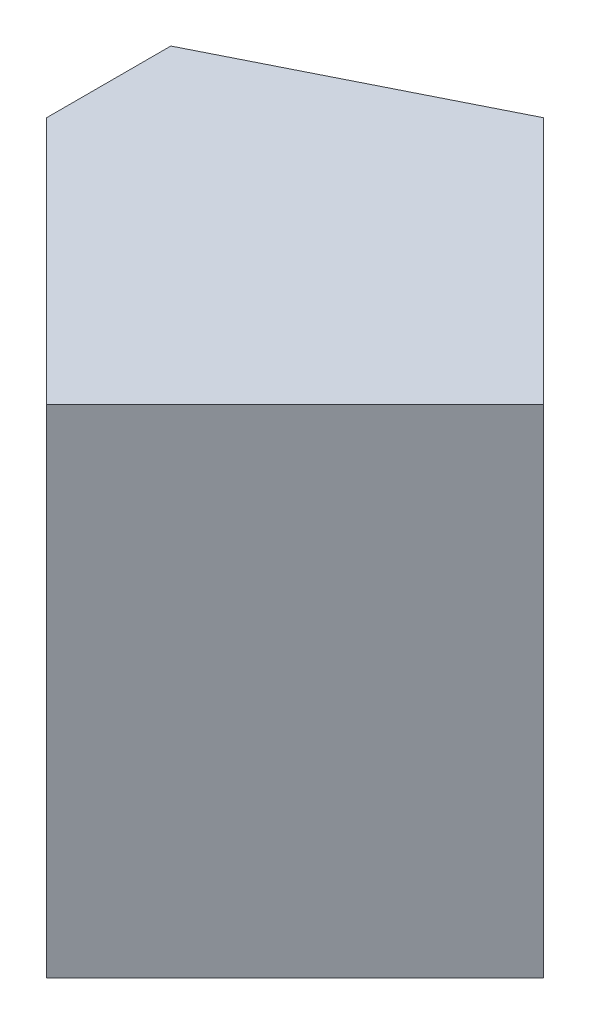
ISO-10303-21;
HEADER;
FILE_DESCRIPTION(('STEP AP214'),'2;1');
FILE_NAME('part.step','',(''),(''),'','','');
FILE_SCHEMA(('AUTOMOTIVE_DESIGN { 1 0 10303 214 1 1 1 1 }'));
ENDSEC;
DATA;
#1=APPLICATION_CONTEXT('core data for automotive mechanical design processes');
#2=APPLICATION_PROTOCOL_DEFINITION('international standard','automotive_design',2000,#1);
#3=PRODUCT_CONTEXT('',#1,'mechanical');
#4=PRODUCT('Part','Part','',(#3));
#5=PRODUCT_RELATED_PRODUCT_CATEGORY('part','',(#4));
#6=PRODUCT_DEFINITION_FORMATION('','',#4);
#7=PRODUCT_DEFINITION_CONTEXT('part definition',#1,'design');
#8=PRODUCT_DEFINITION('design','',#6,#7);
#9=PRODUCT_DEFINITION_SHAPE('','',#8);
#10=(LENGTH_UNIT() NAMED_UNIT(*) SI_UNIT(.MILLI.,.METRE.));
#11=(NAMED_UNIT(*) PLANE_ANGLE_UNIT() SI_UNIT($,.RADIAN.));
#12=(NAMED_UNIT(*) SI_UNIT($,.STERADIAN.) SOLID_ANGLE_UNIT());
#13=UNCERTAINTY_MEASURE_WITH_UNIT(LENGTH_MEASURE(1.E-05),#10,'distance_accuracy_value','');
#14=(GEOMETRIC_REPRESENTATION_CONTEXT(3) GLOBAL_UNCERTAINTY_ASSIGNED_CONTEXT((#13)) GLOBAL_UNIT_ASSIGNED_CONTEXT((#10,
#11,#12)) REPRESENTATION_CONTEXT('',''));
#15=CARTESIAN_POINT('',(0.,0.,0.));
#16=DIRECTION('',(0.,0.,1.));
#17=DIRECTION('',(1.,0.,0.));
#18=AXIS2_PLACEMENT_3D('',#15,#16,#17);
#19=CARTESIAN_POINT('',(0.,0.,20.));
#20=DIRECTION('',(1.,0.,0.));
#21=DIRECTION('',(0.,0.,-1.));
#22=AXIS2_PLACEMENT_3D('',#19,#20,#21);
#23=PLANE('',#22);
#24=DIRECTION('',(0.,0.,-1.));
#25=VECTOR('',#24,1.);
#26=CARTESIAN_POINT('',(0.,20.,20.));
#27=LINE('',#26,#25);
#28=CARTESIAN_POINT('',(0.,20.,10.));
#29=VERTEX_POINT('',#28);
#30=CARTESIAN_POINT('',(0.,20.,5.));
#31=VERTEX_POINT('',#30);
#32=EDGE_CURVE('E41',#29,#31,#27,.T.);
#33=ORIENTED_EDGE('',*,*,#32,.T.);
#34=DIRECTION('',(0.,1.,0.));
#35=VECTOR('',#34,1.);
#36=CARTESIAN_POINT('',(0.,0.,5.));
#37=LINE('',#36,#35);
#38=CARTESIAN_POINT('',(0.,0.,5.));
#39=VERTEX_POINT('',#38);
#40=EDGE_CURVE('E78',#39,#31,#37,.T.);
#41=ORIENTED_EDGE('',*,*,#40,.F.);
#42=DIRECTION('',(0.,0.,-1.));
#43=VECTOR('',#42,1.);
#44=CARTESIAN_POINT('',(0.,0.,20.));
#45=LINE('',#44,#43);
#46=CARTESIAN_POINT('',(0.,0.,10.));
#47=VERTEX_POINT('',#46);
#48=EDGE_CURVE('E11',#47,#39,#45,.T.);
#49=ORIENTED_EDGE('',*,*,#48,.F.);
#50=DIRECTION('',(0.,1.,0.));
#51=VECTOR('',#50,1.);
#52=CARTESIAN_POINT('',(0.,0.,10.));
#53=LINE('',#52,#51);
#54=EDGE_CURVE('E98',#47,#29,#53,.T.);
#55=ORIENTED_EDGE('',*,*,#54,.T.);
#56=EDGE_LOOP('',(#33,#41,#49,#55));
#57=FACE_BOUND('',#56,.T.);
#58=ADVANCED_FACE('F33',(#57),#23,.F.);
#59=CARTESIAN_POINT('',(0.,0.,20.));
#60=DIRECTION('',(0.,1.,0.));
#61=DIRECTION('',(0.,0.,1.));
#62=AXIS2_PLACEMENT_3D('',#59,#60,#61);
#63=PLANE('',#62);
#64=ORIENTED_EDGE('',*,*,#48,.T.);
#65=DIRECTION('',(0.894427190999916,0.,-0.447213595499958));
#66=VECTOR('',#65,1.);
#67=CARTESIAN_POINT('',(10.,0.,0.));
#68=LINE('',#67,#66);
#69=CARTESIAN_POINT('',(10.,0.,0.));
#70=VERTEX_POINT('',#69);
#71=EDGE_CURVE('E75',#39,#70,#68,.T.);
#72=ORIENTED_EDGE('',*,*,#71,.T.);
#73=DIRECTION('',(0.707106781186548,0.,0.707106781186548));
#74=VECTOR('',#73,1.);
#75=CARTESIAN_POINT('',(10.,0.,0.));
#76=LINE('',#75,#74);
#77=CARTESIAN_POINT('',(20.,0.,10.));
#78=VERTEX_POINT('',#77);
#79=EDGE_CURVE('E111',#70,#78,#76,.T.);
#80=ORIENTED_EDGE('',*,*,#79,.T.);
#81=DIRECTION('',(-0.707106781186548,0.,0.707106781186548));
#82=VECTOR('',#81,1.);
#83=CARTESIAN_POINT('',(10.,0.,20.));
#84=LINE('',#83,#82);
#85=CARTESIAN_POINT('',(10.,0.,20.));
#86=VERTEX_POINT('',#85);
#87=EDGE_CURVE('E47',#78,#86,#84,.T.);
#88=ORIENTED_EDGE('',*,*,#87,.T.);
#89=DIRECTION('',(-0.707106781186548,0.,-0.707106781186548));
#90=VECTOR('',#89,1.);
#91=CARTESIAN_POINT('',(10.,0.,20.));
#92=LINE('',#91,#90);
#93=EDGE_CURVE('E96',#86,#47,#92,.T.);
#94=ORIENTED_EDGE('',*,*,#93,.T.);
#95=EDGE_LOOP('',(#64,#72,#80,#88,#94));
#96=FACE_BOUND('',#95,.T.);
#97=ADVANCED_FACE('F95',(#96),#63,.F.);
#98=CARTESIAN_POINT('',(0.,20.,20.));
#99=DIRECTION('',(0.,-1.,0.));
#100=DIRECTION('',(0.,0.,-1.));
#101=AXIS2_PLACEMENT_3D('',#98,#99,#100);
#102=PLANE('',#101);
#103=DIRECTION('',(0.707106781186548,0.,0.707106781186548));
#104=VECTOR('',#103,1.);
#105=CARTESIAN_POINT('',(10.,20.,0.));
#106=LINE('',#105,#104);
#107=CARTESIAN_POINT('',(10.,20.,0.));
#108=VERTEX_POINT('',#107);
#109=CARTESIAN_POINT('',(20.,20.,10.));
#110=VERTEX_POINT('',#109);
#111=EDGE_CURVE('E110',#108,#110,#106,.T.);
#112=ORIENTED_EDGE('',*,*,#111,.F.);
#113=DIRECTION('',(0.894427190999916,0.,-0.447213595499958));
#114=VECTOR('',#113,1.);
#115=CARTESIAN_POINT('',(10.,20.,0.));
#116=LINE('',#115,#114);
#117=EDGE_CURVE('E85',#31,#108,#116,.T.);
#118=ORIENTED_EDGE('',*,*,#117,.F.);
#119=ORIENTED_EDGE('',*,*,#32,.F.);
#120=DIRECTION('',(-0.707106781186548,0.,-0.707106781186548));
#121=VECTOR('',#120,1.);
#122=CARTESIAN_POINT('',(10.,20.,20.));
#123=LINE('',#122,#121);
#124=CARTESIAN_POINT('',(10.,20.,20.));
#125=VERTEX_POINT('',#124);
#126=EDGE_CURVE('E92',#125,#29,#123,.T.);
#127=ORIENTED_EDGE('',*,*,#126,.F.);
#128=DIRECTION('',(-0.707106781186548,0.,0.707106781186548));
#129=VECTOR('',#128,1.);
#130=CARTESIAN_POINT('',(10.,20.,20.));
#131=LINE('',#130,#129);
#132=EDGE_CURVE('E100',#110,#125,#131,.T.);
#133=ORIENTED_EDGE('',*,*,#132,.F.);
#134=EDGE_LOOP('',(#112,#118,#119,#127,#133));
#135=FACE_BOUND('',#134,.T.);
#136=ADVANCED_FACE('F122',(#135),#102,.F.);
#137=CARTESIAN_POINT('',(10.,0.,0.));
#138=DIRECTION('',(-0.707106781186548,0.,0.707106781186548));
#139=DIRECTION('',(0.707106781186548,0.,0.707106781186548));
#140=AXIS2_PLACEMENT_3D('',#137,#138,#139);
#141=PLANE('',#140);
#142=ORIENTED_EDGE('',*,*,#111,.T.);
#143=DIRECTION('',(0.,1.,0.));
#144=VECTOR('',#143,1.);
#145=CARTESIAN_POINT('',(20.,0.,10.));
#146=LINE('',#145,#144);
#147=EDGE_CURVE('E115',#78,#110,#146,.T.);
#148=ORIENTED_EDGE('',*,*,#147,.F.);
#149=ORIENTED_EDGE('',*,*,#79,.F.);
#150=DIRECTION('',(0.,1.,0.));
#151=VECTOR('',#150,1.);
#152=CARTESIAN_POINT('',(10.,0.,0.));
#153=LINE('',#152,#151);
#154=EDGE_CURVE('E81',#70,#108,#153,.T.);
#155=ORIENTED_EDGE('',*,*,#154,.T.);
#156=EDGE_LOOP('',(#142,#148,#149,#155));
#157=FACE_BOUND('',#156,.T.);
#158=ADVANCED_FACE('F119',(#157),#141,.F.);
#159=CARTESIAN_POINT('',(10.,0.,20.));
#160=DIRECTION('',(-0.707106781186548,0.,-0.707106781186548));
#161=DIRECTION('',(-0.707106781186548,0.,0.707106781186548));
#162=AXIS2_PLACEMENT_3D('',#159,#160,#161);
#163=PLANE('',#162);
#164=ORIENTED_EDGE('',*,*,#132,.T.);
#165=DIRECTION('',(0.,1.,0.));
#166=VECTOR('',#165,1.);
#167=CARTESIAN_POINT('',(10.,0.,20.));
#168=LINE('',#167,#166);
#169=EDGE_CURVE('E106',#86,#125,#168,.T.);
#170=ORIENTED_EDGE('',*,*,#169,.F.);
#171=ORIENTED_EDGE('',*,*,#87,.F.);
#172=ORIENTED_EDGE('',*,*,#147,.T.);
#173=EDGE_LOOP('',(#164,#170,#171,#172));
#174=FACE_BOUND('',#173,.T.);
#175=ADVANCED_FACE('F124',(#174),#163,.F.);
#176=CARTESIAN_POINT('',(10.,0.,20.));
#177=DIRECTION('',(0.707106781186548,0.,-0.707106781186548));
#178=DIRECTION('',(-0.707106781186548,0.,-0.707106781186548));
#179=AXIS2_PLACEMENT_3D('',#176,#177,#178);
#180=PLANE('',#179);
#181=ORIENTED_EDGE('',*,*,#126,.T.);
#182=ORIENTED_EDGE('',*,*,#54,.F.);
#183=ORIENTED_EDGE('',*,*,#93,.F.);
#184=ORIENTED_EDGE('',*,*,#169,.T.);
#185=EDGE_LOOP('',(#181,#182,#183,#184));
#186=FACE_BOUND('',#185,.T.);
#187=ADVANCED_FACE('F125',(#186),#180,.F.);
#188=CARTESIAN_POINT('',(10.,0.,0.));
#189=DIRECTION('',(0.447213595499958,0.,0.894427190999916));
#190=DIRECTION('',(0.894427190999916,0.,-0.447213595499958));
#191=AXIS2_PLACEMENT_3D('',#188,#189,#190);
#192=PLANE('',#191);
#193=ORIENTED_EDGE('',*,*,#117,.T.);
#194=ORIENTED_EDGE('',*,*,#154,.F.);
#195=ORIENTED_EDGE('',*,*,#71,.F.);
#196=ORIENTED_EDGE('',*,*,#40,.T.);
#197=EDGE_LOOP('',(#193,#194,#195,#196));
#198=FACE_BOUND('',#197,.T.);
#199=ADVANCED_FACE('F77',(#198),#192,.F.);
#200=CLOSED_SHELL('',(#58,#97,#136,#158,#175,#187,#199));
#201=MANIFOLD_SOLID_BREP('B2',#200);
#202=ADVANCED_BREP_SHAPE_REPRESENTATION('',(#18,#201),#14);
#203=SHAPE_DEFINITION_REPRESENTATION(#9,#202);
ENDSEC;
END-ISO-10303-21;
